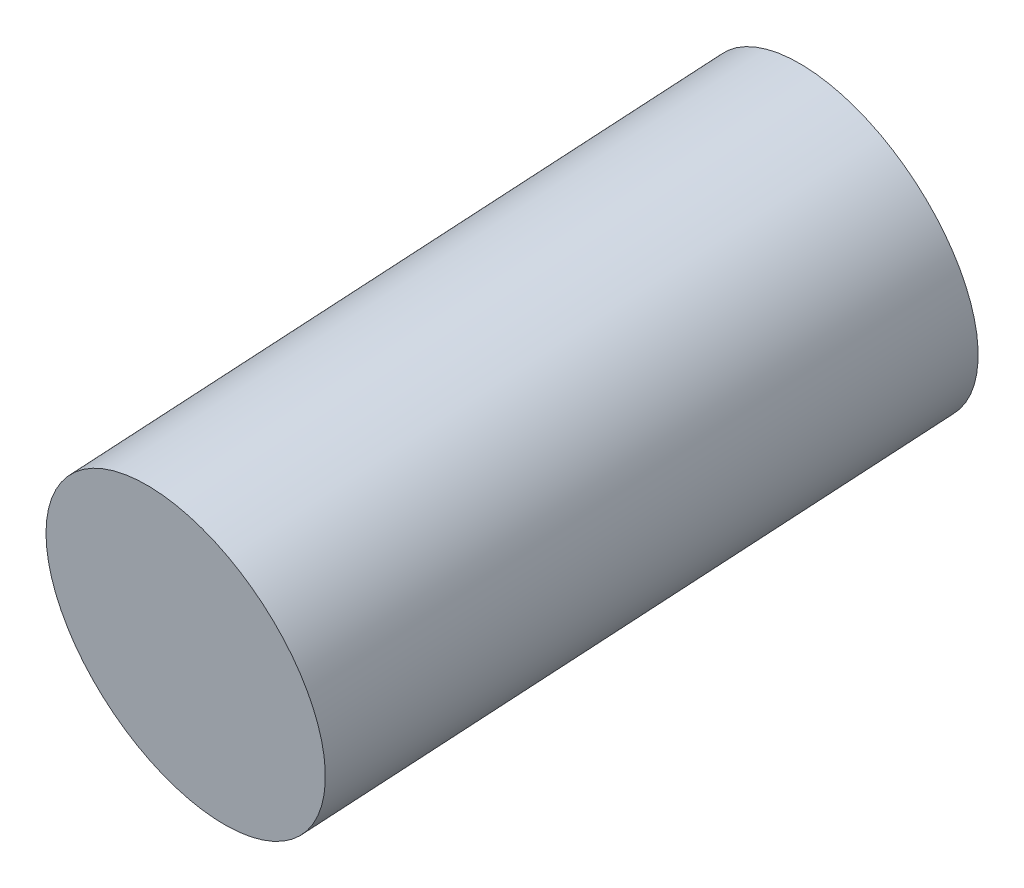
ISO-10303-21;
HEADER;
FILE_DESCRIPTION(('STEP AP214'),'2;1');
FILE_NAME('part.step','',(''),(''),'','','');
FILE_SCHEMA(('AUTOMOTIVE_DESIGN { 1 0 10303 214 1 1 1 1 }'));
ENDSEC;
DATA;
#1=APPLICATION_CONTEXT('core data for automotive mechanical design processes');
#2=APPLICATION_PROTOCOL_DEFINITION('international standard','automotive_design',2000,#1);
#3=PRODUCT_CONTEXT('',#1,'mechanical');
#4=PRODUCT('Part','Part','',(#3));
#5=PRODUCT_RELATED_PRODUCT_CATEGORY('part','',(#4));
#6=PRODUCT_DEFINITION_FORMATION('','',#4);
#7=PRODUCT_DEFINITION_CONTEXT('part definition',#1,'design');
#8=PRODUCT_DEFINITION('design','',#6,#7);
#9=PRODUCT_DEFINITION_SHAPE('','',#8);
#10=(LENGTH_UNIT() NAMED_UNIT(*) SI_UNIT(.MILLI.,.METRE.));
#11=(NAMED_UNIT(*) PLANE_ANGLE_UNIT() SI_UNIT($,.RADIAN.));
#12=(NAMED_UNIT(*) SI_UNIT($,.STERADIAN.) SOLID_ANGLE_UNIT());
#13=UNCERTAINTY_MEASURE_WITH_UNIT(LENGTH_MEASURE(1.E-05),#10,'distance_accuracy_value','');
#14=(GEOMETRIC_REPRESENTATION_CONTEXT(3) GLOBAL_UNCERTAINTY_ASSIGNED_CONTEXT((#13)) GLOBAL_UNIT_ASSIGNED_CONTEXT((#10,
#11,#12)) REPRESENTATION_CONTEXT('',''));
#15=CARTESIAN_POINT('',(0.,0.,0.));
#16=DIRECTION('',(0.,0.,1.));
#17=DIRECTION('',(1.,0.,0.));
#18=AXIS2_PLACEMENT_3D('',#15,#16,#17);
#19=CARTESIAN_POINT('',(5.46326660671932,9.46265533813224,5.55625000000001));
#20=DIRECTION('',(-0.0868240888334639,-0.150383733180433,0.984807753012209));
#21=DIRECTION('',(-0.492403876506106,-0.852868531952443,-0.173648177666928));
#22=AXIS2_PLACEMENT_3D('',#19,#20,#21);
#23=CYLINDRICAL_SURFACE('',#22,1.93220030269667);
#24=CARTESIAN_POINT('',(5.55784215191023,9.62646498755644,4.48352085995661));
#25=DIRECTION('',(-0.0868240888334639,-0.150383733180433,0.984807753012209));
#26=DIRECTION('',(-0.492403876506105,-0.852868531952443,-0.173648177666928));
#27=AXIS2_PLACEMENT_3D('',#24,#25,#26);
#28=CIRCLE('',#27,1.93220030269667);
#29=CARTESIAN_POINT('',(4.60641923267612,7.97855215195747,4.14799779850585));
#30=VERTEX_POINT('',#29);
#31=EDGE_CURVE('E19',#30,#30,#28,.T.);
#32=ORIENTED_EDGE('',*,*,#31,.F.);
#33=EDGE_LOOP('',(#32));
#34=FACE_BOUND('',#33,.T.);
#35=CARTESIAN_POINT('',(6.2330440818747,10.7959490356235,-3.175));
#36=DIRECTION('',(-0.0868240888334639,-0.150383733180433,0.984807753012209));
#37=DIRECTION('',(-0.492403876506105,-0.852868531952443,-0.173648177666928));
#38=AXIS2_PLACEMENT_3D('',#35,#36,#37);
#39=CIRCLE('',#38,1.93220030269668);
#40=CARTESIAN_POINT('',(5.28162116264059,9.14803620002452,-3.51052306145076));
#41=VERTEX_POINT('',#40);
#42=EDGE_CURVE('E10',#41,#41,#39,.T.);
#43=ORIENTED_EDGE('',*,*,#42,.T.);
#44=EDGE_LOOP('',(#43));
#45=FACE_BOUND('',#44,.T.);
#46=ADVANCED_FACE('F15',(#34,#45),#23,.T.);
#47=CARTESIAN_POINT('',(7.18446700110881,12.4438618712224,-2.83947693854923));
#48=DIRECTION('',(-0.0868240888334639,-0.150383733180433,0.984807753012209));
#49=DIRECTION('',(-0.492403876506105,-0.852868531952443,-0.173648177666928));
#50=AXIS2_PLACEMENT_3D('',#47,#48,#49);
#51=PLANE('',#50);
#52=ORIENTED_EDGE('',*,*,#42,.F.);
#53=EDGE_LOOP('',(#52));
#54=FACE_BOUND('',#53,.T.);
#55=ADVANCED_FACE('F30',(#54),#51,.F.);
#56=CARTESIAN_POINT('',(5.55784215191023,9.62646498755644,4.48352085995661));
#57=DIRECTION('',(0.0868240888334639,0.150383733180433,-0.984807753012209));
#58=DIRECTION('',(0.492403876506105,0.852868531952443,0.173648177666928));
#59=AXIS2_PLACEMENT_3D('',#56,#57,#58);
#60=PLANE('',#59);
#61=ORIENTED_EDGE('',*,*,#31,.T.);
#62=EDGE_LOOP('',(#61));
#63=FACE_BOUND('',#62,.T.);
#64=ADVANCED_FACE('F17',(#63),#60,.F.);
#65=CLOSED_SHELL('',(#46,#55,#64));
#66=MANIFOLD_SOLID_BREP('B1',#65);
#67=ADVANCED_BREP_SHAPE_REPRESENTATION('',(#18,#66),#14);
#68=SHAPE_DEFINITION_REPRESENTATION(#9,#67);
ENDSEC;
END-ISO-10303-21;
